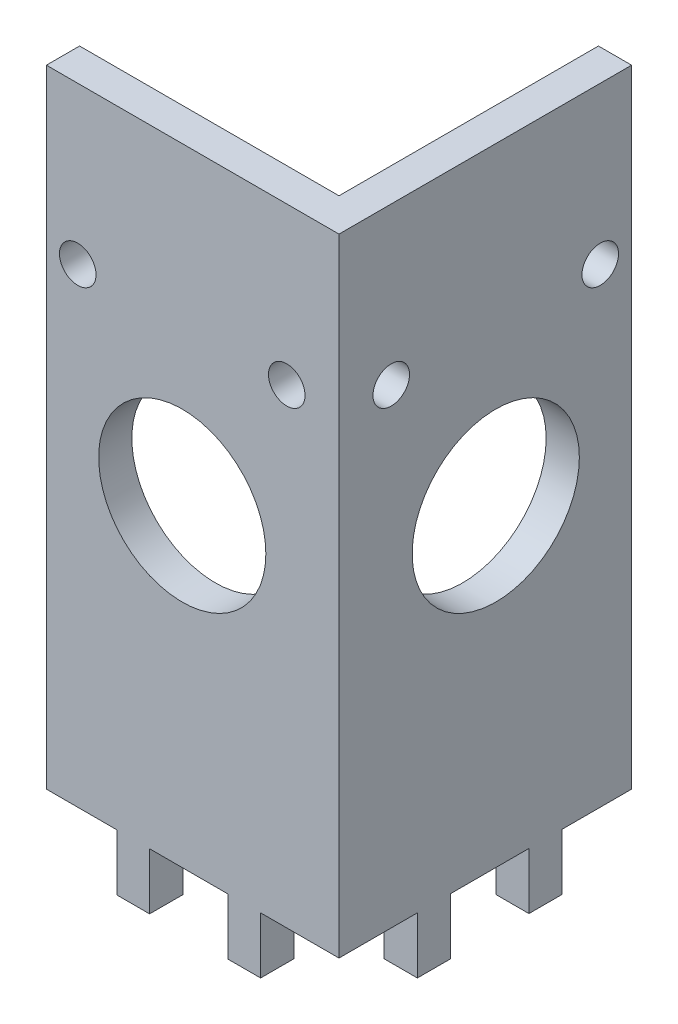
ISO-10303-21;
HEADER;
FILE_DESCRIPTION(('STEP AP214'),'2;1');
FILE_NAME('part.step','',(''),(''),'','','');
FILE_SCHEMA(('AUTOMOTIVE_DESIGN { 1 0 10303 214 1 1 1 1 }'));
ENDSEC;
DATA;
#1=APPLICATION_CONTEXT('core data for automotive mechanical design processes');
#2=APPLICATION_PROTOCOL_DEFINITION('international standard','automotive_design',2000,#1);
#3=PRODUCT_CONTEXT('',#1,'mechanical');
#4=PRODUCT('Part','Part','',(#3));
#5=PRODUCT_RELATED_PRODUCT_CATEGORY('part','',(#4));
#6=PRODUCT_DEFINITION_FORMATION('','',#4);
#7=PRODUCT_DEFINITION_CONTEXT('part definition',#1,'design');
#8=PRODUCT_DEFINITION('design','',#6,#7);
#9=PRODUCT_DEFINITION_SHAPE('','',#8);
#10=(LENGTH_UNIT() NAMED_UNIT(*) SI_UNIT(.MILLI.,.METRE.));
#11=(NAMED_UNIT(*) PLANE_ANGLE_UNIT() SI_UNIT($,.RADIAN.));
#12=(NAMED_UNIT(*) SI_UNIT($,.STERADIAN.) SOLID_ANGLE_UNIT());
#13=UNCERTAINTY_MEASURE_WITH_UNIT(LENGTH_MEASURE(1.E-05),#10,'distance_accuracy_value','');
#14=(GEOMETRIC_REPRESENTATION_CONTEXT(3) GLOBAL_UNCERTAINTY_ASSIGNED_CONTEXT((#13)) GLOBAL_UNIT_ASSIGNED_CONTEXT((#10,
#11,#12)) REPRESENTATION_CONTEXT('',''));
#15=CARTESIAN_POINT('',(0.,0.,0.));
#16=DIRECTION('',(0.,0.,1.));
#17=DIRECTION('',(1.,0.,0.));
#18=AXIS2_PLACEMENT_3D('',#15,#16,#17);
#19=CARTESIAN_POINT('',(0.,60.,-22.5));
#20=DIRECTION('',(0.,0.,-1.));
#21=DIRECTION('',(-1.,0.,0.));
#22=AXIS2_PLACEMENT_3D('',#19,#20,#21);
#23=PLANE('',#22);
#24=DIRECTION('',(1.,0.,0.));
#25=VECTOR('',#24,1.);
#26=CARTESIAN_POINT('',(0.,0.,-22.5));
#27=LINE('',#26,#25);
#28=CARTESIAN_POINT('',(-30.,0.,-22.5));
#29=VERTEX_POINT('',#28);
#30=CARTESIAN_POINT('',(-22.5,0.,-22.5));
#31=VERTEX_POINT('',#30);
#32=EDGE_CURVE('E354',#29,#31,#27,.T.);
#33=ORIENTED_EDGE('',*,*,#32,.T.);
#34=DIRECTION('',(0.,-1.,0.));
#35=VECTOR('',#34,1.);
#36=CARTESIAN_POINT('',(-22.5,60.,-22.5));
#37=LINE('',#36,#35);
#38=CARTESIAN_POINT('',(-22.5,60.,-22.5));
#39=VERTEX_POINT('',#38);
#40=EDGE_CURVE('E11',#39,#31,#37,.T.);
#41=ORIENTED_EDGE('',*,*,#40,.F.);
#42=DIRECTION('',(1.,0.,0.));
#43=VECTOR('',#42,1.);
#44=CARTESIAN_POINT('',(0.,60.,-22.5));
#45=LINE('',#44,#43);
#46=CARTESIAN_POINT('',(-50.5,60.,-22.5));
#47=VERTEX_POINT('',#46);
#48=EDGE_CURVE('E363',#47,#39,#45,.T.);
#49=ORIENTED_EDGE('',*,*,#48,.F.);
#50=DIRECTION('',(0.,-1.,0.));
#51=VECTOR('',#50,1.);
#52=CARTESIAN_POINT('',(-50.5,60.,-22.5));
#53=LINE('',#52,#51);
#54=CARTESIAN_POINT('',(-50.5,0.,-22.5));
#55=VERTEX_POINT('',#54);
#56=EDGE_CURVE('E384',#47,#55,#53,.T.);
#57=ORIENTED_EDGE('',*,*,#56,.T.);
#58=CARTESIAN_POINT('',(-43.75,0.,-22.5));
#59=VERTEX_POINT('',#58);
#60=EDGE_CURVE('E385',#55,#59,#27,.T.);
#61=ORIENTED_EDGE('',*,*,#60,.T.);
#62=DIRECTION('',(0.,1.,0.));
#63=VECTOR('',#62,1.);
#64=CARTESIAN_POINT('',(-43.75,0.,-22.5));
#65=LINE('',#64,#63);
#66=CARTESIAN_POINT('',(-43.75,-5.4,-22.5));
#67=VERTEX_POINT('',#66);
#68=EDGE_CURVE('E318',#67,#59,#65,.T.);
#69=ORIENTED_EDGE('',*,*,#68,.F.);
#70=DIRECTION('',(1.,0.,0.));
#71=VECTOR('',#70,1.);
#72=CARTESIAN_POINT('',(0.,-5.4,-22.5));
#73=LINE('',#72,#71);
#74=CARTESIAN_POINT('',(-40.625,-5.4,-22.5));
#75=VERTEX_POINT('',#74);
#76=EDGE_CURVE('E343',#67,#75,#73,.T.);
#77=ORIENTED_EDGE('',*,*,#76,.T.);
#78=DIRECTION('',(0.,1.,0.));
#79=VECTOR('',#78,1.);
#80=CARTESIAN_POINT('',(-40.625,0.,-22.5));
#81=LINE('',#80,#79);
#82=CARTESIAN_POINT('',(-40.625,0.,-22.5));
#83=VERTEX_POINT('',#82);
#84=EDGE_CURVE('E332',#75,#83,#81,.T.);
#85=ORIENTED_EDGE('',*,*,#84,.T.);
#86=CARTESIAN_POINT('',(-33.125,0.,-22.5));
#87=VERTEX_POINT('',#86);
#88=EDGE_CURVE('E389',#83,#87,#27,.T.);
#89=ORIENTED_EDGE('',*,*,#88,.T.);
#90=DIRECTION('',(0.,1.,0.));
#91=VECTOR('',#90,1.);
#92=CARTESIAN_POINT('',(-33.125,0.,-22.5));
#93=LINE('',#92,#91);
#94=CARTESIAN_POINT('',(-33.125,-5.4,-22.5));
#95=VERTEX_POINT('',#94);
#96=EDGE_CURVE('E297',#95,#87,#93,.T.);
#97=ORIENTED_EDGE('',*,*,#96,.F.);
#98=DIRECTION('',(-1.,0.,0.));
#99=VECTOR('',#98,1.);
#100=CARTESIAN_POINT('',(0.,-5.40000000000001,-22.5));
#101=LINE('',#100,#99);
#102=CARTESIAN_POINT('',(-30.,-5.4,-22.5));
#103=VERTEX_POINT('',#102);
#104=EDGE_CURVE('E288',#103,#95,#101,.T.);
#105=ORIENTED_EDGE('',*,*,#104,.F.);
#106=DIRECTION('',(0.,1.,0.));
#107=VECTOR('',#106,1.);
#108=CARTESIAN_POINT('',(-30.,0.,-22.5));
#109=LINE('',#108,#107);
#110=EDGE_CURVE('E308',#103,#29,#109,.T.);
#111=ORIENTED_EDGE('',*,*,#110,.T.);
#112=EDGE_LOOP('',(#33,#41,#49,#57,#61,#69,#77,#85,#89,#97,#105,#111));
#113=FACE_BOUND('',#112,.T.);
#114=CARTESIAN_POINT('',(-37.5,30.,-22.5));
#115=DIRECTION('',(0.,0.,1.));
#116=DIRECTION('',(1.,0.,0.));
#117=AXIS2_PLACEMENT_3D('',#114,#115,#116);
#118=CIRCLE('',#117,8.);
#119=CARTESIAN_POINT('',(-29.5,30.,-22.5));
#120=VERTEX_POINT('',#119);
#121=EDGE_CURVE('E280',#120,#120,#118,.T.);
#122=ORIENTED_EDGE('',*,*,#121,.F.);
#123=EDGE_LOOP('',(#122));
#124=FACE_BOUND('',#123,.T.);
#125=CARTESIAN_POINT('',(-27.5,45.,-22.5));
#126=DIRECTION('',(0.,0.,1.));
#127=DIRECTION('',(1.,0.,0.));
#128=AXIS2_PLACEMENT_3D('',#125,#126,#127);
#129=CIRCLE('',#128,1.75);
#130=CARTESIAN_POINT('',(-25.75,45.,-22.5));
#131=VERTEX_POINT('',#130);
#132=EDGE_CURVE('E444',#131,#131,#129,.F.);
#133=ORIENTED_EDGE('',*,*,#132,.T.);
#134=EDGE_LOOP('',(#133));
#135=FACE_BOUND('',#134,.T.);
#136=CARTESIAN_POINT('',(-47.5,45.,-22.5));
#137=DIRECTION('',(0.,0.,1.));
#138=DIRECTION('',(1.,0.,0.));
#139=AXIS2_PLACEMENT_3D('',#136,#137,#138);
#140=CIRCLE('',#139,1.75);
#141=CARTESIAN_POINT('',(-45.75,45.,-22.5));
#142=VERTEX_POINT('',#141);
#143=EDGE_CURVE('E432',#142,#142,#140,.T.);
#144=ORIENTED_EDGE('',*,*,#143,.F.);
#145=EDGE_LOOP('',(#144));
#146=FACE_BOUND('',#145,.T.);
#147=ADVANCED_FACE('F40',(#113,#124,#135,#146),#23,.F.);
#148=CARTESIAN_POINT('',(0.,60.,-25.675));
#149=DIRECTION('',(0.,0.,1.));
#150=DIRECTION('',(1.,0.,0.));
#151=AXIS2_PLACEMENT_3D('',#148,#149,#150);
#152=PLANE('',#151);
#153=DIRECTION('',(-1.,0.,0.));
#154=VECTOR('',#153,1.);
#155=CARTESIAN_POINT('',(0.,0.,-25.675));
#156=LINE('',#155,#154);
#157=CARTESIAN_POINT('',(-25.675,0.,-25.675));
#158=VERTEX_POINT('',#157);
#159=CARTESIAN_POINT('',(-30.,0.,-25.675));
#160=VERTEX_POINT('',#159);
#161=EDGE_CURVE('E405',#158,#160,#156,.T.);
#162=ORIENTED_EDGE('',*,*,#161,.T.);
#163=DIRECTION('',(0.,1.,0.));
#164=VECTOR('',#163,1.);
#165=CARTESIAN_POINT('',(-30.,0.,-25.675));
#166=LINE('',#165,#164);
#167=CARTESIAN_POINT('',(-30.,-5.4,-25.675));
#168=VERTEX_POINT('',#167);
#169=EDGE_CURVE('E296',#168,#160,#166,.T.);
#170=ORIENTED_EDGE('',*,*,#169,.F.);
#171=DIRECTION('',(-1.,0.,0.));
#172=VECTOR('',#171,1.);
#173=CARTESIAN_POINT('',(0.,-5.40000000000001,-25.675));
#174=LINE('',#173,#172);
#175=CARTESIAN_POINT('',(-33.125,-5.4,-25.675));
#176=VERTEX_POINT('',#175);
#177=EDGE_CURVE('E292',#168,#176,#174,.T.);
#178=ORIENTED_EDGE('',*,*,#177,.T.);
#179=DIRECTION('',(0.,1.,0.));
#180=VECTOR('',#179,1.);
#181=CARTESIAN_POINT('',(-33.125,0.,-25.675));
#182=LINE('',#181,#180);
#183=CARTESIAN_POINT('',(-33.125,0.,-25.675));
#184=VERTEX_POINT('',#183);
#185=EDGE_CURVE('E300',#176,#184,#182,.T.);
#186=ORIENTED_EDGE('',*,*,#185,.T.);
#187=CARTESIAN_POINT('',(-40.625,0.,-25.675));
#188=VERTEX_POINT('',#187);
#189=EDGE_CURVE('E409',#184,#188,#156,.T.);
#190=ORIENTED_EDGE('',*,*,#189,.T.);
#191=DIRECTION('',(0.,1.,0.));
#192=VECTOR('',#191,1.);
#193=CARTESIAN_POINT('',(-40.625,0.,-25.675));
#194=LINE('',#193,#192);
#195=CARTESIAN_POINT('',(-40.625,-5.4,-25.675));
#196=VERTEX_POINT('',#195);
#197=EDGE_CURVE('E336',#196,#188,#194,.T.);
#198=ORIENTED_EDGE('',*,*,#197,.F.);
#199=DIRECTION('',(1.,0.,0.));
#200=VECTOR('',#199,1.);
#201=CARTESIAN_POINT('',(0.,-5.4,-25.675));
#202=LINE('',#201,#200);
#203=CARTESIAN_POINT('',(-43.75,-5.4,-25.675));
#204=VERTEX_POINT('',#203);
#205=EDGE_CURVE('E331',#204,#196,#202,.T.);
#206=ORIENTED_EDGE('',*,*,#205,.F.);
#207=DIRECTION('',(0.,1.,0.));
#208=VECTOR('',#207,1.);
#209=CARTESIAN_POINT('',(-43.75,0.,-25.675));
#210=LINE('',#209,#208);
#211=CARTESIAN_POINT('',(-43.75,0.,-25.675));
#212=VERTEX_POINT('',#211);
#213=EDGE_CURVE('E328',#204,#212,#210,.T.);
#214=ORIENTED_EDGE('',*,*,#213,.T.);
#215=CARTESIAN_POINT('',(-50.5,0.,-25.675));
#216=VERTEX_POINT('',#215);
#217=EDGE_CURVE('E403',#212,#216,#156,.T.);
#218=ORIENTED_EDGE('',*,*,#217,.T.);
#219=DIRECTION('',(0.,-1.,0.));
#220=VECTOR('',#219,1.);
#221=CARTESIAN_POINT('',(-50.5,60.,-25.675));
#222=LINE('',#221,#220);
#223=CARTESIAN_POINT('',(-50.5,60.,-25.675));
#224=VERTEX_POINT('',#223);
#225=EDGE_CURVE('E415',#224,#216,#222,.T.);
#226=ORIENTED_EDGE('',*,*,#225,.F.);
#227=DIRECTION('',(-1.,0.,0.));
#228=VECTOR('',#227,1.);
#229=CARTESIAN_POINT('',(0.,60.,-25.675));
#230=LINE('',#229,#228);
#231=CARTESIAN_POINT('',(-25.675,60.,-25.675));
#232=VERTEX_POINT('',#231);
#233=EDGE_CURVE('E377',#232,#224,#230,.T.);
#234=ORIENTED_EDGE('',*,*,#233,.F.);
#235=DIRECTION('',(0.,-1.,0.));
#236=VECTOR('',#235,1.);
#237=CARTESIAN_POINT('',(-25.675,60.,-25.675));
#238=LINE('',#237,#236);
#239=EDGE_CURVE('E419',#232,#158,#238,.T.);
#240=ORIENTED_EDGE('',*,*,#239,.T.);
#241=EDGE_LOOP('',(#162,#170,#178,#186,#190,#198,#206,#214,#218,#226,#234,#240));
#242=FACE_BOUND('',#241,.T.);
#243=CARTESIAN_POINT('',(-37.5,30.,-25.675));
#244=DIRECTION('',(0.,0.,1.));
#245=DIRECTION('',(1.,0.,0.));
#246=AXIS2_PLACEMENT_3D('',#243,#244,#245);
#247=CIRCLE('',#246,8.);
#248=CARTESIAN_POINT('',(-29.5,30.,-25.675));
#249=VERTEX_POINT('',#248);
#250=EDGE_CURVE('E284',#249,#249,#247,.T.);
#251=ORIENTED_EDGE('',*,*,#250,.T.);
#252=EDGE_LOOP('',(#251));
#253=FACE_BOUND('',#252,.T.);
#254=CARTESIAN_POINT('',(-27.5,45.,-25.675));
#255=DIRECTION('',(0.,0.,1.));
#256=DIRECTION('',(1.,0.,0.));
#257=AXIS2_PLACEMENT_3D('',#254,#255,#256);
#258=CIRCLE('',#257,1.75);
#259=CARTESIAN_POINT('',(-25.75,45.,-25.675));
#260=VERTEX_POINT('',#259);
#261=EDGE_CURVE('E428',#260,#260,#258,.F.);
#262=ORIENTED_EDGE('',*,*,#261,.F.);
#263=EDGE_LOOP('',(#262));
#264=FACE_BOUND('',#263,.T.);
#265=CARTESIAN_POINT('',(-47.5,45.,-25.675));
#266=DIRECTION('',(0.,0.,1.));
#267=DIRECTION('',(1.,0.,0.));
#268=AXIS2_PLACEMENT_3D('',#265,#266,#267);
#269=CIRCLE('',#268,1.75);
#270=CARTESIAN_POINT('',(-45.75,45.,-25.675));
#271=VERTEX_POINT('',#270);
#272=EDGE_CURVE('E225',#271,#271,#269,.T.);
#273=ORIENTED_EDGE('',*,*,#272,.T.);
#274=EDGE_LOOP('',(#273));
#275=FACE_BOUND('',#274,.T.);
#276=ADVANCED_FACE('F469',(#242,#253,#264,#275),#152,.F.);
#277=CARTESIAN_POINT('',(0.,0.,0.));
#278=DIRECTION('',(0.,1.,0.));
#279=DIRECTION('',(0.,0.,1.));
#280=AXIS2_PLACEMENT_3D('',#277,#278,#279);
#281=PLANE('',#280);
#282=DIRECTION('',(1.,0.,0.));
#283=VECTOR('',#282,1.);
#284=CARTESIAN_POINT('',(-25.675,0.,-40.675));
#285=LINE('',#284,#283);
#286=CARTESIAN_POINT('',(-25.675,0.,-40.675));
#287=VERTEX_POINT('',#286);
#288=CARTESIAN_POINT('',(-22.5,0.,-40.675));
#289=VERTEX_POINT('',#288);
#290=EDGE_CURVE('E65',#287,#289,#285,.T.);
#291=ORIENTED_EDGE('',*,*,#290,.T.);
#292=DIRECTION('',(0.,0.,-1.));
#293=VECTOR('',#292,1.);
#294=CARTESIAN_POINT('',(-22.5,0.,0.));
#295=LINE('',#294,#293);
#296=CARTESIAN_POINT('',(-22.5,0.,-33.175));
#297=VERTEX_POINT('',#296);
#298=EDGE_CURVE('E395',#297,#289,#295,.T.);
#299=ORIENTED_EDGE('',*,*,#298,.F.);
#300=DIRECTION('',(1.,0.,0.));
#301=VECTOR('',#300,1.);
#302=CARTESIAN_POINT('',(-25.675,0.,-33.175));
#303=LINE('',#302,#301);
#304=CARTESIAN_POINT('',(-25.675,0.,-33.175));
#305=VERTEX_POINT('',#304);
#306=EDGE_CURVE('E267',#305,#297,#303,.T.);
#307=ORIENTED_EDGE('',*,*,#306,.F.);
#308=DIRECTION('',(0.,0.,-1.));
#309=VECTOR('',#308,1.);
#310=CARTESIAN_POINT('',(-25.675,0.,0.));
#311=LINE('',#310,#309);
#312=EDGE_CURVE('E404',#305,#287,#311,.T.);
#313=ORIENTED_EDGE('',*,*,#312,.T.);
#314=EDGE_LOOP('',(#291,#299,#307,#313));
#315=FACE_BOUND('',#314,.T.);
#316=ADVANCED_FACE('F472',(#315),#281,.F.);
#317=DIRECTION('',(1.,0.,0.));
#318=VECTOR('',#317,1.);
#319=CARTESIAN_POINT('',(-25.675,0.,-30.));
#320=LINE('',#319,#318);
#321=CARTESIAN_POINT('',(-25.675,0.,-30.));
#322=VERTEX_POINT('',#321);
#323=CARTESIAN_POINT('',(-22.5,0.,-30.));
#324=VERTEX_POINT('',#323);
#325=EDGE_CURVE('E263',#322,#324,#320,.T.);
#326=ORIENTED_EDGE('',*,*,#325,.T.);
#327=EDGE_CURVE('E390',#31,#324,#295,.T.);
#328=ORIENTED_EDGE('',*,*,#327,.F.);
#329=ORIENTED_EDGE('',*,*,#32,.F.);
#330=DIRECTION('',(0.,0.,1.));
#331=VECTOR('',#330,1.);
#332=CARTESIAN_POINT('',(-30.,0.,-25.675));
#333=LINE('',#332,#331);
#334=EDGE_CURVE('E323',#160,#29,#333,.T.);
#335=ORIENTED_EDGE('',*,*,#334,.F.);
#336=ORIENTED_EDGE('',*,*,#161,.F.);
#337=EDGE_CURVE('E400',#158,#322,#311,.T.);
#338=ORIENTED_EDGE('',*,*,#337,.T.);
#339=EDGE_LOOP('',(#326,#328,#329,#335,#336,#338));
#340=FACE_BOUND('',#339,.T.);
#341=ADVANCED_FACE('F620',(#340),#281,.F.);
#342=DIRECTION('',(0.,0.,1.));
#343=VECTOR('',#342,1.);
#344=CARTESIAN_POINT('',(-33.125,0.,-25.675));
#345=LINE('',#344,#343);
#346=EDGE_CURVE('E319',#184,#87,#345,.T.);
#347=ORIENTED_EDGE('',*,*,#346,.T.);
#348=ORIENTED_EDGE('',*,*,#88,.F.);
#349=DIRECTION('',(0.,0.,1.));
#350=VECTOR('',#349,1.);
#351=CARTESIAN_POINT('',(-40.625,0.,-25.675));
#352=LINE('',#351,#350);
#353=EDGE_CURVE('E355',#188,#83,#352,.T.);
#354=ORIENTED_EDGE('',*,*,#353,.F.);
#355=ORIENTED_EDGE('',*,*,#189,.F.);
#356=EDGE_LOOP('',(#347,#348,#354,#355));
#357=FACE_BOUND('',#356,.T.);
#358=ADVANCED_FACE('F561',(#357),#281,.F.);
#359=CARTESIAN_POINT('',(-22.5,0.,-43.85));
#360=VERTEX_POINT('',#359);
#361=CARTESIAN_POINT('',(-22.5,0.,-50.5));
#362=VERTEX_POINT('',#361);
#363=EDGE_CURVE('E57',#360,#362,#295,.T.);
#364=ORIENTED_EDGE('',*,*,#363,.F.);
#365=DIRECTION('',(1.,0.,0.));
#366=VECTOR('',#365,1.);
#367=CARTESIAN_POINT('',(-25.675,0.,-43.85));
#368=LINE('',#367,#366);
#369=CARTESIAN_POINT('',(-25.675,0.,-43.85));
#370=VERTEX_POINT('',#369);
#371=EDGE_CURVE('E234',#370,#360,#368,.T.);
#372=ORIENTED_EDGE('',*,*,#371,.F.);
#373=CARTESIAN_POINT('',(-25.675,0.,-50.5));
#374=VERTEX_POINT('',#373);
#375=EDGE_CURVE('E399',#370,#374,#311,.T.);
#376=ORIENTED_EDGE('',*,*,#375,.T.);
#377=DIRECTION('',(-1.,0.,0.));
#378=VECTOR('',#377,1.);
#379=CARTESIAN_POINT('',(2.20733317888072E-13,0.,-50.4999999999999));
#380=LINE('',#379,#378);
#381=EDGE_CURVE('E394',#362,#374,#380,.T.);
#382=ORIENTED_EDGE('',*,*,#381,.F.);
#383=EDGE_LOOP('',(#364,#372,#376,#382));
#384=FACE_BOUND('',#383,.T.);
#385=ADVANCED_FACE('F545',(#384),#281,.F.);
#386=CARTESIAN_POINT('',(-22.5,60.,0.));
#387=DIRECTION('',(-1.,0.,0.));
#388=DIRECTION('',(0.,0.,1.));
#389=AXIS2_PLACEMENT_3D('',#386,#387,#388);
#390=PLANE('',#389);
#391=CARTESIAN_POINT('',(-22.5,45.,-47.5));
#392=DIRECTION('',(1.,0.,0.));
#393=DIRECTION('',(0.,0.,-1.));
#394=AXIS2_PLACEMENT_3D('',#391,#392,#393);
#395=CIRCLE('',#394,1.75);
#396=CARTESIAN_POINT('',(-22.5,45.,-49.25));
#397=VERTEX_POINT('',#396);
#398=EDGE_CURVE('E438',#397,#397,#395,.T.);
#399=ORIENTED_EDGE('',*,*,#398,.F.);
#400=EDGE_LOOP('',(#399));
#401=FACE_BOUND('',#400,.T.);
#402=CARTESIAN_POINT('',(-22.5,45.,-27.5));
#403=DIRECTION('',(1.,0.,0.));
#404=DIRECTION('',(0.,0.,1.));
#405=AXIS2_PLACEMENT_3D('',#402,#403,#404);
#406=CIRCLE('',#405,1.75);
#407=CARTESIAN_POINT('',(-22.5,45.,-25.75));
#408=VERTEX_POINT('',#407);
#409=EDGE_CURVE('E446',#408,#408,#406,.T.);
#410=ORIENTED_EDGE('',*,*,#409,.F.);
#411=EDGE_LOOP('',(#410));
#412=FACE_BOUND('',#411,.T.);
#413=CARTESIAN_POINT('',(-22.5,30.,-37.5));
#414=DIRECTION('',(1.,0.,0.));
#415=DIRECTION('',(0.,0.,-1.));
#416=AXIS2_PLACEMENT_3D('',#413,#414,#415);
#417=CIRCLE('',#416,8.);
#418=CARTESIAN_POINT('',(-22.5,30.,-45.5));
#419=VERTEX_POINT('',#418);
#420=EDGE_CURVE('E266',#419,#419,#417,.T.);
#421=ORIENTED_EDGE('',*,*,#420,.F.);
#422=EDGE_LOOP('',(#421));
#423=FACE_BOUND('',#422,.T.);
#424=ORIENTED_EDGE('',*,*,#327,.T.);
#425=DIRECTION('',(0.,1.,0.));
#426=VECTOR('',#425,1.);
#427=CARTESIAN_POINT('',(-22.5,0.,-30.));
#428=LINE('',#427,#426);
#429=CARTESIAN_POINT('',(-22.5,-5.4,-30.));
#430=VERTEX_POINT('',#429);
#431=EDGE_CURVE('E233',#430,#324,#428,.T.);
#432=ORIENTED_EDGE('',*,*,#431,.F.);
#433=DIRECTION('',(0.,0.,-1.));
#434=VECTOR('',#433,1.);
#435=CARTESIAN_POINT('',(-22.5,-5.4,0.));
#436=LINE('',#435,#434);
#437=CARTESIAN_POINT('',(-22.5,-5.4,-33.175));
#438=VERTEX_POINT('',#437);
#439=EDGE_CURVE('E256',#430,#438,#436,.T.);
#440=ORIENTED_EDGE('',*,*,#439,.T.);
#441=DIRECTION('',(0.,1.,0.));
#442=VECTOR('',#441,1.);
#443=CARTESIAN_POINT('',(-22.5,0.,-33.175));
#444=LINE('',#443,#442);
#445=EDGE_CURVE('E244',#438,#297,#444,.T.);
#446=ORIENTED_EDGE('',*,*,#445,.T.);
#447=ORIENTED_EDGE('',*,*,#298,.T.);
#448=DIRECTION('',(0.,1.,0.));
#449=VECTOR('',#448,1.);
#450=CARTESIAN_POINT('',(-22.5,0.,-40.675));
#451=LINE('',#450,#449);
#452=CARTESIAN_POINT('',(-22.5,-5.4,-40.675));
#453=VERTEX_POINT('',#452);
#454=EDGE_CURVE('E222',#453,#289,#451,.T.);
#455=ORIENTED_EDGE('',*,*,#454,.F.);
#456=DIRECTION('',(0.,0.,-1.));
#457=VECTOR('',#456,1.);
#458=CARTESIAN_POINT('',(-22.5,-5.40000000000001,0.));
#459=LINE('',#458,#457);
#460=CARTESIAN_POINT('',(-22.5,-5.4,-43.85));
#461=VERTEX_POINT('',#460);
#462=EDGE_CURVE('E197',#453,#461,#459,.T.);
#463=ORIENTED_EDGE('',*,*,#462,.T.);
#464=DIRECTION('',(0.,1.,0.));
#465=VECTOR('',#464,1.);
#466=CARTESIAN_POINT('',(-22.5,0.,-43.85));
#467=LINE('',#466,#465);
#468=EDGE_CURVE('E210',#461,#360,#467,.T.);
#469=ORIENTED_EDGE('',*,*,#468,.T.);
#470=ORIENTED_EDGE('',*,*,#363,.T.);
#471=DIRECTION('',(0.,-1.,0.));
#472=VECTOR('',#471,1.);
#473=CARTESIAN_POINT('',(-22.5,60.,-50.5));
#474=LINE('',#473,#472);
#475=CARTESIAN_POINT('',(-22.5,60.,-50.5));
#476=VERTEX_POINT('',#475);
#477=EDGE_CURVE('E49',#476,#362,#474,.T.);
#478=ORIENTED_EDGE('',*,*,#477,.F.);
#479=DIRECTION('',(0.,0.,-1.));
#480=VECTOR('',#479,1.);
#481=CARTESIAN_POINT('',(-22.5,60.,0.));
#482=LINE('',#481,#480);
#483=EDGE_CURVE('E366',#39,#476,#482,.T.);
#484=ORIENTED_EDGE('',*,*,#483,.F.);
#485=ORIENTED_EDGE('',*,*,#40,.T.);
#486=EDGE_LOOP('',(#424,#432,#440,#446,#447,#455,#463,#469,#470,#478,#484,#485));
#487=FACE_BOUND('',#486,.T.);
#488=ADVANCED_FACE('F554',(#401,#412,#423,#487),#390,.F.);
#489=CARTESIAN_POINT('',(2.20733317888072E-13,60.,-50.4999999999999));
#490=DIRECTION('',(0.,0.,1.));
#491=DIRECTION('',(1.,0.,0.));
#492=AXIS2_PLACEMENT_3D('',#489,#490,#491);
#493=PLANE('',#492);
#494=ORIENTED_EDGE('',*,*,#381,.T.);
#495=DIRECTION('',(0.,-1.,0.));
#496=VECTOR('',#495,1.);
#497=CARTESIAN_POINT('',(-25.675,60.,-50.5));
#498=LINE('',#497,#496);
#499=CARTESIAN_POINT('',(-25.675,60.,-50.5));
#500=VERTEX_POINT('',#499);
#501=EDGE_CURVE('E422',#500,#374,#498,.T.);
#502=ORIENTED_EDGE('',*,*,#501,.F.);
#503=DIRECTION('',(-1.,0.,0.));
#504=VECTOR('',#503,1.);
#505=CARTESIAN_POINT('',(2.20733317888072E-13,60.,-50.4999999999999));
#506=LINE('',#505,#504);
#507=EDGE_CURVE('E370',#476,#500,#506,.T.);
#508=ORIENTED_EDGE('',*,*,#507,.F.);
#509=ORIENTED_EDGE('',*,*,#477,.T.);
#510=EDGE_LOOP('',(#494,#502,#508,#509));
#511=FACE_BOUND('',#510,.T.);
#512=ADVANCED_FACE('F551',(#511),#493,.F.);
#513=CARTESIAN_POINT('',(-25.675,60.,0.));
#514=DIRECTION('',(-1.,0.,0.));
#515=DIRECTION('',(0.,0.,1.));
#516=AXIS2_PLACEMENT_3D('',#513,#514,#515);
#517=PLANE('',#516);
#518=CARTESIAN_POINT('',(-25.675,45.,-47.5));
#519=DIRECTION('',(-1.,0.,0.));
#520=DIRECTION('',(0.,0.,1.));
#521=AXIS2_PLACEMENT_3D('',#518,#519,#520);
#522=CIRCLE('',#521,1.75);
#523=CARTESIAN_POINT('',(-25.675,45.,-45.75));
#524=VERTEX_POINT('',#523);
#525=EDGE_CURVE('E43',#524,#524,#522,.T.);
#526=ORIENTED_EDGE('',*,*,#525,.F.);
#527=EDGE_LOOP('',(#526));
#528=FACE_BOUND('',#527,.T.);
#529=CARTESIAN_POINT('',(-25.675,45.,-27.5));
#530=DIRECTION('',(-1.,0.,0.));
#531=DIRECTION('',(0.,0.,1.));
#532=AXIS2_PLACEMENT_3D('',#529,#530,#531);
#533=CIRCLE('',#532,1.75);
#534=CARTESIAN_POINT('',(-25.675,45.,-25.75));
#535=VERTEX_POINT('',#534);
#536=EDGE_CURVE('E435',#535,#535,#533,.T.);
#537=ORIENTED_EDGE('',*,*,#536,.F.);
#538=EDGE_LOOP('',(#537));
#539=FACE_BOUND('',#538,.T.);
#540=CARTESIAN_POINT('',(-25.675,30.,-37.5));
#541=DIRECTION('',(1.,0.,0.));
#542=DIRECTION('',(0.,0.,-1.));
#543=AXIS2_PLACEMENT_3D('',#540,#541,#542);
#544=CIRCLE('',#543,8.);
#545=CARTESIAN_POINT('',(-25.675,30.,-45.5));
#546=VERTEX_POINT('',#545);
#547=EDGE_CURVE('E276',#546,#546,#544,.T.);
#548=ORIENTED_EDGE('',*,*,#547,.T.);
#549=EDGE_LOOP('',(#548));
#550=FACE_BOUND('',#549,.T.);
#551=ORIENTED_EDGE('',*,*,#501,.T.);
#552=ORIENTED_EDGE('',*,*,#375,.F.);
#553=DIRECTION('',(0.,1.,0.));
#554=VECTOR('',#553,1.);
#555=CARTESIAN_POINT('',(-25.675,0.,-43.85));
#556=LINE('',#555,#554);
#557=CARTESIAN_POINT('',(-25.675,-5.4,-43.85));
#558=VERTEX_POINT('',#557);
#559=EDGE_CURVE('E203',#558,#370,#556,.T.);
#560=ORIENTED_EDGE('',*,*,#559,.F.);
#561=DIRECTION('',(0.,0.,-1.));
#562=VECTOR('',#561,1.);
#563=CARTESIAN_POINT('',(-25.675,-5.40000000000001,0.));
#564=LINE('',#563,#562);
#565=CARTESIAN_POINT('',(-25.675,-5.4,-40.675));
#566=VERTEX_POINT('',#565);
#567=EDGE_CURVE('E195',#566,#558,#564,.T.);
#568=ORIENTED_EDGE('',*,*,#567,.F.);
#569=DIRECTION('',(0.,1.,0.));
#570=VECTOR('',#569,1.);
#571=CARTESIAN_POINT('',(-25.675,0.,-40.675));
#572=LINE('',#571,#570);
#573=EDGE_CURVE('E206',#566,#287,#572,.T.);
#574=ORIENTED_EDGE('',*,*,#573,.T.);
#575=ORIENTED_EDGE('',*,*,#312,.F.);
#576=DIRECTION('',(0.,1.,0.));
#577=VECTOR('',#576,1.);
#578=CARTESIAN_POINT('',(-25.675,0.,-33.175));
#579=LINE('',#578,#577);
#580=CARTESIAN_POINT('',(-25.675,-5.4,-33.175));
#581=VERTEX_POINT('',#580);
#582=EDGE_CURVE('E248',#581,#305,#579,.T.);
#583=ORIENTED_EDGE('',*,*,#582,.F.);
#584=DIRECTION('',(0.,0.,-1.));
#585=VECTOR('',#584,1.);
#586=CARTESIAN_POINT('',(-25.675,-5.4,0.));
#587=LINE('',#586,#585);
#588=CARTESIAN_POINT('',(-25.675,-5.4,-30.));
#589=VERTEX_POINT('',#588);
#590=EDGE_CURVE('E243',#589,#581,#587,.T.);
#591=ORIENTED_EDGE('',*,*,#590,.F.);
#592=DIRECTION('',(0.,1.,0.));
#593=VECTOR('',#592,1.);
#594=CARTESIAN_POINT('',(-25.675,0.,-30.));
#595=LINE('',#594,#593);
#596=EDGE_CURVE('E239',#589,#322,#595,.T.);
#597=ORIENTED_EDGE('',*,*,#596,.T.);
#598=ORIENTED_EDGE('',*,*,#337,.F.);
#599=ORIENTED_EDGE('',*,*,#239,.F.);
#600=DIRECTION('',(0.,0.,-1.));
#601=VECTOR('',#600,1.);
#602=CARTESIAN_POINT('',(-25.675,60.,0.));
#603=LINE('',#602,#601);
#604=EDGE_CURVE('E373',#232,#500,#603,.T.);
#605=ORIENTED_EDGE('',*,*,#604,.T.);
#606=EDGE_LOOP('',(#551,#552,#560,#568,#574,#575,#583,#591,#597,#598,#599,#605));
#607=FACE_BOUND('',#606,.T.);
#608=ADVANCED_FACE('F214',(#528,#539,#550,#607),#517,.T.);
#609=CARTESIAN_POINT('',(-50.5,60.,0.));
#610=DIRECTION('',(-1.,0.,0.));
#611=DIRECTION('',(0.,0.,1.));
#612=AXIS2_PLACEMENT_3D('',#609,#610,#611);
#613=PLANE('',#612);
#614=DIRECTION('',(0.,0.,-1.));
#615=VECTOR('',#614,1.);
#616=CARTESIAN_POINT('',(-50.5,0.,0.));
#617=LINE('',#616,#615);
#618=EDGE_CURVE('E367',#55,#216,#617,.T.);
#619=ORIENTED_EDGE('',*,*,#618,.F.);
#620=ORIENTED_EDGE('',*,*,#56,.F.);
#621=DIRECTION('',(0.,0.,-1.));
#622=VECTOR('',#621,1.);
#623=CARTESIAN_POINT('',(-50.5,60.,0.));
#624=LINE('',#623,#622);
#625=EDGE_CURVE('E380',#47,#224,#624,.T.);
#626=ORIENTED_EDGE('',*,*,#625,.T.);
#627=ORIENTED_EDGE('',*,*,#225,.T.);
#628=EDGE_LOOP('',(#619,#620,#626,#627));
#629=FACE_BOUND('',#628,.T.);
#630=ADVANCED_FACE('F540',(#629),#613,.T.);
#631=CARTESIAN_POINT('',(0.,60.,0.));
#632=DIRECTION('',(0.,1.,0.));
#633=DIRECTION('',(0.,0.,1.));
#634=AXIS2_PLACEMENT_3D('',#631,#632,#633);
#635=PLANE('',#634);
#636=ORIENTED_EDGE('',*,*,#604,.F.);
#637=ORIENTED_EDGE('',*,*,#233,.T.);
#638=ORIENTED_EDGE('',*,*,#625,.F.);
#639=ORIENTED_EDGE('',*,*,#48,.T.);
#640=ORIENTED_EDGE('',*,*,#483,.T.);
#641=ORIENTED_EDGE('',*,*,#507,.T.);
#642=EDGE_LOOP('',(#636,#637,#638,#639,#640,#641));
#643=FACE_BOUND('',#642,.T.);
#644=ADVANCED_FACE('F537',(#643),#635,.T.);
#645=ORIENTED_EDGE('',*,*,#217,.F.);
#646=DIRECTION('',(0.,0.,1.));
#647=VECTOR('',#646,1.);
#648=CARTESIAN_POINT('',(-43.75,0.,-25.675));
#649=LINE('',#648,#647);
#650=EDGE_CURVE('E350',#212,#59,#649,.T.);
#651=ORIENTED_EDGE('',*,*,#650,.T.);
#652=ORIENTED_EDGE('',*,*,#60,.F.);
#653=ORIENTED_EDGE('',*,*,#618,.T.);
#654=EDGE_LOOP('',(#645,#651,#652,#653));
#655=FACE_BOUND('',#654,.T.);
#656=ADVANCED_FACE('F535',(#655),#281,.F.);
#657=CARTESIAN_POINT('',(-43.75,0.,-25.675));
#658=DIRECTION('',(1.,0.,0.));
#659=DIRECTION('',(0.,0.,-1.));
#660=AXIS2_PLACEMENT_3D('',#657,#658,#659);
#661=PLANE('',#660);
#662=ORIENTED_EDGE('',*,*,#68,.T.);
#663=ORIENTED_EDGE('',*,*,#650,.F.);
#664=ORIENTED_EDGE('',*,*,#213,.F.);
#665=DIRECTION('',(0.,0.,1.));
#666=VECTOR('',#665,1.);
#667=CARTESIAN_POINT('',(-43.75,-5.4,-25.675));
#668=LINE('',#667,#666);
#669=EDGE_CURVE('E340',#204,#67,#668,.T.);
#670=ORIENTED_EDGE('',*,*,#669,.T.);
#671=EDGE_LOOP('',(#662,#663,#664,#670));
#672=FACE_BOUND('',#671,.T.);
#673=ADVANCED_FACE('F528',(#672),#661,.F.);
#674=CARTESIAN_POINT('',(-40.625,0.,-25.675));
#675=DIRECTION('',(1.,0.,0.));
#676=DIRECTION('',(0.,0.,-1.));
#677=AXIS2_PLACEMENT_3D('',#674,#675,#676);
#678=PLANE('',#677);
#679=ORIENTED_EDGE('',*,*,#84,.F.);
#680=DIRECTION('',(0.,0.,1.));
#681=VECTOR('',#680,1.);
#682=CARTESIAN_POINT('',(-40.625,-5.4,-25.675));
#683=LINE('',#682,#681);
#684=EDGE_CURVE('E358',#196,#75,#683,.T.);
#685=ORIENTED_EDGE('',*,*,#684,.F.);
#686=ORIENTED_EDGE('',*,*,#197,.T.);
#687=ORIENTED_EDGE('',*,*,#353,.T.);
#688=EDGE_LOOP('',(#679,#685,#686,#687));
#689=FACE_BOUND('',#688,.T.);
#690=ADVANCED_FACE('F525',(#689),#678,.T.);
#691=CARTESIAN_POINT('',(0.,-5.4,-25.675));
#692=DIRECTION('',(0.,-1.,0.));
#693=DIRECTION('',(0.,0.,-1.));
#694=AXIS2_PLACEMENT_3D('',#691,#692,#693);
#695=PLANE('',#694);
#696=ORIENTED_EDGE('',*,*,#76,.F.);
#697=ORIENTED_EDGE('',*,*,#669,.F.);
#698=ORIENTED_EDGE('',*,*,#205,.T.);
#699=ORIENTED_EDGE('',*,*,#684,.T.);
#700=EDGE_LOOP('',(#696,#697,#698,#699));
#701=FACE_BOUND('',#700,.T.);
#702=ADVANCED_FACE('F523',(#701),#695,.T.);
#703=CARTESIAN_POINT('',(0.,-5.40000000000001,-25.675));
#704=DIRECTION('',(0.,1.,0.));
#705=DIRECTION('',(-1.,0.,0.));
#706=AXIS2_PLACEMENT_3D('',#703,#704,#705);
#707=PLANE('',#706);
#708=ORIENTED_EDGE('',*,*,#104,.T.);
#709=DIRECTION('',(0.,0.,1.));
#710=VECTOR('',#709,1.);
#711=CARTESIAN_POINT('',(-33.125,-5.4,-25.675));
#712=LINE('',#711,#710);
#713=EDGE_CURVE('E314',#176,#95,#712,.T.);
#714=ORIENTED_EDGE('',*,*,#713,.F.);
#715=ORIENTED_EDGE('',*,*,#177,.F.);
#716=DIRECTION('',(0.,0.,1.));
#717=VECTOR('',#716,1.);
#718=CARTESIAN_POINT('',(-30.,-5.4,-25.675));
#719=LINE('',#718,#717);
#720=EDGE_CURVE('E304',#168,#103,#719,.T.);
#721=ORIENTED_EDGE('',*,*,#720,.T.);
#722=EDGE_LOOP('',(#708,#714,#715,#721));
#723=FACE_BOUND('',#722,.T.);
#724=ADVANCED_FACE('F518',(#723),#707,.F.);
#725=CARTESIAN_POINT('',(-33.125,0.,-25.675));
#726=DIRECTION('',(1.,0.,0.));
#727=DIRECTION('',(0.,0.,-1.));
#728=AXIS2_PLACEMENT_3D('',#725,#726,#727);
#729=PLANE('',#728);
#730=ORIENTED_EDGE('',*,*,#96,.T.);
#731=ORIENTED_EDGE('',*,*,#346,.F.);
#732=ORIENTED_EDGE('',*,*,#185,.F.);
#733=ORIENTED_EDGE('',*,*,#713,.T.);
#734=EDGE_LOOP('',(#730,#731,#732,#733));
#735=FACE_BOUND('',#734,.T.);
#736=ADVANCED_FACE('F511',(#735),#729,.F.);
#737=CARTESIAN_POINT('',(-30.,0.,-25.675));
#738=DIRECTION('',(1.,0.,0.));
#739=DIRECTION('',(0.,0.,-1.));
#740=AXIS2_PLACEMENT_3D('',#737,#738,#739);
#741=PLANE('',#740);
#742=ORIENTED_EDGE('',*,*,#110,.F.);
#743=ORIENTED_EDGE('',*,*,#720,.F.);
#744=ORIENTED_EDGE('',*,*,#169,.T.);
#745=ORIENTED_EDGE('',*,*,#334,.T.);
#746=EDGE_LOOP('',(#742,#743,#744,#745));
#747=FACE_BOUND('',#746,.T.);
#748=ADVANCED_FACE('F501',(#747),#741,.T.);
#749=CARTESIAN_POINT('',(-37.5,30.,-25.675));
#750=DIRECTION('',(0.,0.,1.));
#751=DIRECTION('',(1.,0.,0.));
#752=AXIS2_PLACEMENT_3D('',#749,#750,#751);
#753=CYLINDRICAL_SURFACE('',#752,8.);
#754=ORIENTED_EDGE('',*,*,#250,.F.);
#755=EDGE_LOOP('',(#754));
#756=FACE_BOUND('',#755,.T.);
#757=ORIENTED_EDGE('',*,*,#121,.T.);
#758=EDGE_LOOP('',(#757));
#759=FACE_BOUND('',#758,.T.);
#760=ADVANCED_FACE('F498',(#756,#759),#753,.F.);
#761=CARTESIAN_POINT('',(-25.675,30.,-37.5));
#762=DIRECTION('',(1.,0.,0.));
#763=DIRECTION('',(0.,0.,-1.));
#764=AXIS2_PLACEMENT_3D('',#761,#762,#763);
#765=CYLINDRICAL_SURFACE('',#764,8.);
#766=ORIENTED_EDGE('',*,*,#547,.F.);
#767=EDGE_LOOP('',(#766));
#768=FACE_BOUND('',#767,.T.);
#769=ORIENTED_EDGE('',*,*,#420,.T.);
#770=EDGE_LOOP('',(#769));
#771=FACE_BOUND('',#770,.T.);
#772=ADVANCED_FACE('F500',(#768,#771),#765,.F.);
#773=CARTESIAN_POINT('',(-25.675,0.,-30.));
#774=DIRECTION('',(0.,0.,-1.));
#775=DIRECTION('',(0.,1.,0.));
#776=AXIS2_PLACEMENT_3D('',#773,#774,#775);
#777=PLANE('',#776);
#778=ORIENTED_EDGE('',*,*,#431,.T.);
#779=ORIENTED_EDGE('',*,*,#325,.F.);
#780=ORIENTED_EDGE('',*,*,#596,.F.);
#781=DIRECTION('',(1.,0.,0.));
#782=VECTOR('',#781,1.);
#783=CARTESIAN_POINT('',(-25.675,-5.4,-30.));
#784=LINE('',#783,#782);
#785=EDGE_CURVE('E252',#589,#430,#784,.T.);
#786=ORIENTED_EDGE('',*,*,#785,.T.);
#787=EDGE_LOOP('',(#778,#779,#780,#786));
#788=FACE_BOUND('',#787,.T.);
#789=ADVANCED_FACE('F508',(#788),#777,.F.);
#790=CARTESIAN_POINT('',(-25.675,0.,-33.175));
#791=DIRECTION('',(0.,0.,-1.));
#792=DIRECTION('',(-1.,0.,0.));
#793=AXIS2_PLACEMENT_3D('',#790,#791,#792);
#794=PLANE('',#793);
#795=ORIENTED_EDGE('',*,*,#445,.F.);
#796=DIRECTION('',(1.,0.,0.));
#797=VECTOR('',#796,1.);
#798=CARTESIAN_POINT('',(-25.675,-5.4,-33.175));
#799=LINE('',#798,#797);
#800=EDGE_CURVE('E271',#581,#438,#799,.T.);
#801=ORIENTED_EDGE('',*,*,#800,.F.);
#802=ORIENTED_EDGE('',*,*,#582,.T.);
#803=ORIENTED_EDGE('',*,*,#306,.T.);
#804=EDGE_LOOP('',(#795,#801,#802,#803));
#805=FACE_BOUND('',#804,.T.);
#806=ADVANCED_FACE('F579',(#805),#794,.T.);
#807=CARTESIAN_POINT('',(-25.675,-5.4,0.));
#808=DIRECTION('',(0.,-1.,0.));
#809=DIRECTION('',(0.,0.,-1.));
#810=AXIS2_PLACEMENT_3D('',#807,#808,#809);
#811=PLANE('',#810);
#812=ORIENTED_EDGE('',*,*,#439,.F.);
#813=ORIENTED_EDGE('',*,*,#785,.F.);
#814=ORIENTED_EDGE('',*,*,#590,.T.);
#815=ORIENTED_EDGE('',*,*,#800,.T.);
#816=EDGE_LOOP('',(#812,#813,#814,#815));
#817=FACE_BOUND('',#816,.T.);
#818=ADVANCED_FACE('F576',(#817),#811,.T.);
#819=CARTESIAN_POINT('',(-25.675,0.,-40.675));
#820=DIRECTION('',(0.,0.,-1.));
#821=DIRECTION('',(0.,1.,0.));
#822=AXIS2_PLACEMENT_3D('',#819,#820,#821);
#823=PLANE('',#822);
#824=ORIENTED_EDGE('',*,*,#454,.T.);
#825=ORIENTED_EDGE('',*,*,#290,.F.);
#826=ORIENTED_EDGE('',*,*,#573,.F.);
#827=DIRECTION('',(1.,0.,0.));
#828=VECTOR('',#827,1.);
#829=CARTESIAN_POINT('',(-25.675,-5.4,-40.675));
#830=LINE('',#829,#828);
#831=EDGE_CURVE('E191',#566,#453,#830,.T.);
#832=ORIENTED_EDGE('',*,*,#831,.T.);
#833=EDGE_LOOP('',(#824,#825,#826,#832));
#834=FACE_BOUND('',#833,.T.);
#835=ADVANCED_FACE('F207',(#834),#823,.F.);
#836=CARTESIAN_POINT('',(-25.675,0.,-43.85));
#837=DIRECTION('',(0.,0.,-1.));
#838=DIRECTION('',(-1.,0.,0.));
#839=AXIS2_PLACEMENT_3D('',#836,#837,#838);
#840=PLANE('',#839);
#841=ORIENTED_EDGE('',*,*,#468,.F.);
#842=DIRECTION('',(1.,0.,0.));
#843=VECTOR('',#842,1.);
#844=CARTESIAN_POINT('',(-25.675,-5.4,-43.85));
#845=LINE('',#844,#843);
#846=EDGE_CURVE('E202',#558,#461,#845,.T.);
#847=ORIENTED_EDGE('',*,*,#846,.F.);
#848=ORIENTED_EDGE('',*,*,#559,.T.);
#849=ORIENTED_EDGE('',*,*,#371,.T.);
#850=EDGE_LOOP('',(#841,#847,#848,#849));
#851=FACE_BOUND('',#850,.T.);
#852=ADVANCED_FACE('F707',(#851),#840,.T.);
#853=CARTESIAN_POINT('',(-25.675,-5.40000000000001,0.));
#854=DIRECTION('',(0.,-1.,0.));
#855=DIRECTION('',(0.,0.,-1.));
#856=AXIS2_PLACEMENT_3D('',#853,#854,#855);
#857=PLANE('',#856);
#858=ORIENTED_EDGE('',*,*,#462,.F.);
#859=ORIENTED_EDGE('',*,*,#831,.F.);
#860=ORIENTED_EDGE('',*,*,#567,.T.);
#861=ORIENTED_EDGE('',*,*,#846,.T.);
#862=EDGE_LOOP('',(#858,#859,#860,#861));
#863=FACE_BOUND('',#862,.T.);
#864=ADVANCED_FACE('F193',(#863),#857,.T.);
#865=CARTESIAN_POINT('',(-27.5,45.,-32.5));
#866=DIRECTION('',(0.,0.,1.));
#867=DIRECTION('',(1.,0.,0.));
#868=AXIS2_PLACEMENT_3D('',#865,#866,#867);
#869=CYLINDRICAL_SURFACE('',#868,1.75);
#870=ORIENTED_EDGE('',*,*,#132,.F.);
#871=EDGE_LOOP('',(#870));
#872=FACE_BOUND('',#871,.T.);
#873=ORIENTED_EDGE('',*,*,#261,.T.);
#874=EDGE_LOOP('',(#873));
#875=FACE_BOUND('',#874,.T.);
#876=ADVANCED_FACE('F462',(#872,#875),#869,.F.);
#877=CARTESIAN_POINT('',(-47.5,45.,-32.5));
#878=DIRECTION('',(0.,0.,1.));
#879=DIRECTION('',(1.,0.,0.));
#880=AXIS2_PLACEMENT_3D('',#877,#878,#879);
#881=CYLINDRICAL_SURFACE('',#880,1.75);
#882=ORIENTED_EDGE('',*,*,#143,.T.);
#883=EDGE_LOOP('',(#882));
#884=FACE_BOUND('',#883,.T.);
#885=ORIENTED_EDGE('',*,*,#272,.F.);
#886=EDGE_LOOP('',(#885));
#887=FACE_BOUND('',#886,.T.);
#888=ADVANCED_FACE('F465',(#884,#887),#881,.F.);
#889=CARTESIAN_POINT('',(-32.5,45.,-27.5));
#890=DIRECTION('',(1.,0.,0.));
#891=DIRECTION('',(0.,0.,-1.));
#892=AXIS2_PLACEMENT_3D('',#889,#890,#891);
#893=CYLINDRICAL_SURFACE('',#892,1.75);
#894=ORIENTED_EDGE('',*,*,#536,.T.);
#895=EDGE_LOOP('',(#894));
#896=FACE_BOUND('',#895,.T.);
#897=ORIENTED_EDGE('',*,*,#409,.T.);
#898=EDGE_LOOP('',(#897));
#899=FACE_BOUND('',#898,.T.);
#900=ADVANCED_FACE('F478',(#896,#899),#893,.F.);
#901=CARTESIAN_POINT('',(-32.5,45.,-47.5));
#902=DIRECTION('',(1.,0.,0.));
#903=DIRECTION('',(0.,0.,-1.));
#904=AXIS2_PLACEMENT_3D('',#901,#902,#903);
#905=CYLINDRICAL_SURFACE('',#904,1.75);
#906=ORIENTED_EDGE('',*,*,#525,.T.);
#907=EDGE_LOOP('',(#906));
#908=FACE_BOUND('',#907,.T.);
#909=ORIENTED_EDGE('',*,*,#398,.T.);
#910=EDGE_LOOP('',(#909));
#911=FACE_BOUND('',#910,.T.);
#912=ADVANCED_FACE('F484',(#908,#911),#905,.F.);
#913=CLOSED_SHELL('',(#147,#276,#316,#341,#358,#385,#488,#512,#608,#630,#644,#656,#673,#690,
#702,#724,#736,#748,#760,#772,#789,#806,#818,#835,#852,#864,#876,#888,#900,#912));
#914=MANIFOLD_SOLID_BREP('B2',#913);
#915=ADVANCED_BREP_SHAPE_REPRESENTATION('',(#18,#914),#14);
#916=SHAPE_DEFINITION_REPRESENTATION(#9,#915);
ENDSEC;
END-ISO-10303-21;
